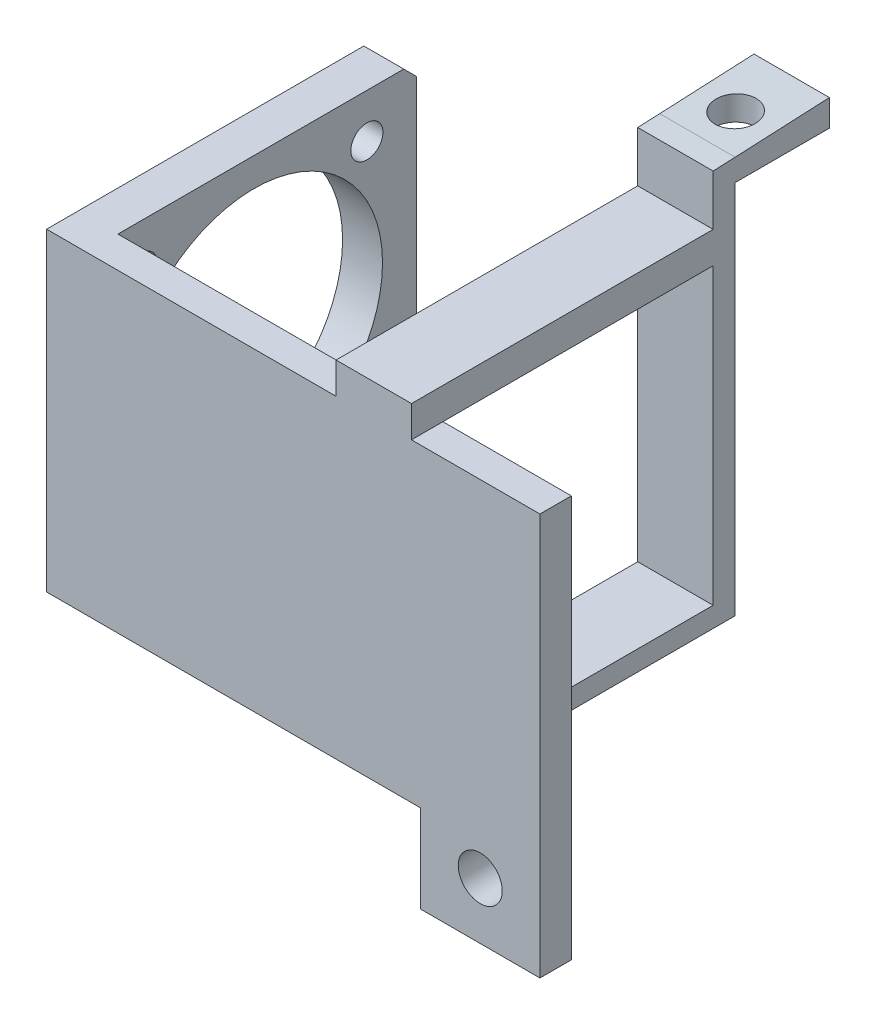
ISO-10303-21;
HEADER;
FILE_DESCRIPTION(('STEP AP214'),'2;1');
FILE_NAME('part.step','',(''),(''),'','','');
FILE_SCHEMA(('AUTOMOTIVE_DESIGN { 1 0 10303 214 1 1 1 1 }'));
ENDSEC;
DATA;
#1=APPLICATION_CONTEXT('core data for automotive mechanical design processes');
#2=APPLICATION_PROTOCOL_DEFINITION('international standard','automotive_design',2000,#1);
#3=PRODUCT_CONTEXT('',#1,'mechanical');
#4=PRODUCT('Part','Part','',(#3));
#5=PRODUCT_RELATED_PRODUCT_CATEGORY('part','',(#4));
#6=PRODUCT_DEFINITION_FORMATION('','',#4);
#7=PRODUCT_DEFINITION_CONTEXT('part definition',#1,'design');
#8=PRODUCT_DEFINITION('design','',#6,#7);
#9=PRODUCT_DEFINITION_SHAPE('','',#8);
#10=(LENGTH_UNIT() NAMED_UNIT(*) SI_UNIT(.MILLI.,.METRE.));
#11=(NAMED_UNIT(*) PLANE_ANGLE_UNIT() SI_UNIT($,.RADIAN.));
#12=(NAMED_UNIT(*) SI_UNIT($,.STERADIAN.) SOLID_ANGLE_UNIT());
#13=UNCERTAINTY_MEASURE_WITH_UNIT(LENGTH_MEASURE(1.E-05),#10,'distance_accuracy_value','');
#14=(GEOMETRIC_REPRESENTATION_CONTEXT(3) GLOBAL_UNCERTAINTY_ASSIGNED_CONTEXT((#13)) GLOBAL_UNIT_ASSIGNED_CONTEXT((#10,
#11,#12)) REPRESENTATION_CONTEXT('',''));
#15=CARTESIAN_POINT('',(0.,0.,0.));
#16=DIRECTION('',(0.,0.,1.));
#17=DIRECTION('',(1.,0.,0.));
#18=AXIS2_PLACEMENT_3D('',#15,#16,#17);
#19=CARTESIAN_POINT('',(0.,0.,0.));
#20=DIRECTION('',(0.,0.,-1.));
#21=DIRECTION('',(-1.,0.,0.));
#22=AXIS2_PLACEMENT_3D('',#19,#20,#21);
#23=PLANE('',#22);
#24=CARTESIAN_POINT('',(69.,-4.93898511090853,0.));
#25=DIRECTION('',(0.,0.,-1.));
#26=DIRECTION('',(-1.,0.,0.));
#27=AXIS2_PLACEMENT_3D('',#24,#25,#26);
#28=CIRCLE('',#27,3.50000000000001);
#29=CARTESIAN_POINT('',(65.5,-4.93898511090853,0.));
#30=VERTEX_POINT('',#29);
#31=EDGE_CURVE('E310',#30,#30,#28,.T.);
#32=ORIENTED_EDGE('',*,*,#31,.F.);
#33=EDGE_LOOP('',(#32));
#34=FACE_BOUND('',#33,.T.);
#35=DIRECTION('',(-1.,0.,0.));
#36=VECTOR('',#35,1.);
#37=CARTESIAN_POINT('',(0.,50.,0.));
#38=LINE('',#37,#36);
#39=CARTESIAN_POINT('',(46.06,50.,0.));
#40=VERTEX_POINT('',#39);
#41=CARTESIAN_POINT('',(6.35,50.,0.));
#42=VERTEX_POINT('',#41);
#43=EDGE_CURVE('E352',#40,#42,#38,.T.);
#44=ORIENTED_EDGE('',*,*,#43,.F.);
#45=DIRECTION('',(-1.,0.,0.));
#46=VECTOR('',#45,1.);
#47=CARTESIAN_POINT('',(58.06,50.,0.));
#48=LINE('',#47,#46);
#49=CARTESIAN_POINT('',(58.06,50.,0.));
#50=VERTEX_POINT('',#49);
#51=EDGE_CURVE('E223',#50,#40,#48,.T.);
#52=ORIENTED_EDGE('',*,*,#51,.F.);
#53=DIRECTION('',(-1.,0.,0.));
#54=VECTOR('',#53,1.);
#55=CARTESIAN_POINT('',(58.06,50.,0.));
#56=LINE('',#55,#54);
#57=CARTESIAN_POINT('',(78.5,50.,0.));
#58=VERTEX_POINT('',#57);
#59=EDGE_CURVE('E382',#58,#50,#56,.T.);
#60=ORIENTED_EDGE('',*,*,#59,.F.);
#61=DIRECTION('',(0.,1.,0.));
#62=VECTOR('',#61,1.);
#63=CARTESIAN_POINT('',(78.5,64.0610148890915,0.));
#64=LINE('',#63,#62);
#65=CARTESIAN_POINT('',(78.5,-13.9389851109085,0.));
#66=VERTEX_POINT('',#65);
#67=EDGE_CURVE('E379',#66,#58,#64,.T.);
#68=ORIENTED_EDGE('',*,*,#67,.F.);
#69=DIRECTION('',(1.,0.,0.));
#70=VECTOR('',#69,1.);
#71=CARTESIAN_POINT('',(78.5,-13.9389851109085,0.));
#72=LINE('',#71,#70);
#73=CARTESIAN_POINT('',(59.5,-13.9389851109085,0.));
#74=VERTEX_POINT('',#73);
#75=EDGE_CURVE('E377',#74,#66,#72,.T.);
#76=ORIENTED_EDGE('',*,*,#75,.F.);
#77=DIRECTION('',(0.,-1.,0.));
#78=VECTOR('',#77,1.);
#79=CARTESIAN_POINT('',(59.5,-13.9389851109085,0.));
#80=LINE('',#79,#78);
#81=CARTESIAN_POINT('',(59.5,0.,0.));
#82=VERTEX_POINT('',#81);
#83=EDGE_CURVE('E375',#82,#74,#80,.T.);
#84=ORIENTED_EDGE('',*,*,#83,.F.);
#85=DIRECTION('',(1.,0.,0.));
#86=VECTOR('',#85,1.);
#87=CARTESIAN_POINT('',(59.5,0.,0.));
#88=LINE('',#87,#86);
#89=CARTESIAN_POINT('',(58.06,0.,0.));
#90=VERTEX_POINT('',#89);
#91=EDGE_CURVE('E347',#90,#82,#88,.T.);
#92=ORIENTED_EDGE('',*,*,#91,.F.);
#93=DIRECTION('',(0.,-1.,0.));
#94=VECTOR('',#93,1.);
#95=CARTESIAN_POINT('',(58.06,0.,0.));
#96=LINE('',#95,#94);
#97=CARTESIAN_POINT('',(58.06,3.2,0.));
#98=VERTEX_POINT('',#97);
#99=EDGE_CURVE('E283',#98,#90,#96,.T.);
#100=ORIENTED_EDGE('',*,*,#99,.F.);
#101=DIRECTION('',(1.,0.,0.));
#102=VECTOR('',#101,1.);
#103=CARTESIAN_POINT('',(58.06,3.2,0.));
#104=LINE('',#103,#102);
#105=CARTESIAN_POINT('',(46.06,3.2,0.));
#106=VERTEX_POINT('',#105);
#107=EDGE_CURVE('E287',#106,#98,#104,.T.);
#108=ORIENTED_EDGE('',*,*,#107,.F.);
#109=DIRECTION('',(0.,1.,0.));
#110=VECTOR('',#109,1.);
#111=CARTESIAN_POINT('',(46.06,0.,0.));
#112=LINE('',#111,#110);
#113=CARTESIAN_POINT('',(46.06,0.,0.));
#114=VERTEX_POINT('',#113);
#115=EDGE_CURVE('E295',#114,#106,#112,.T.);
#116=ORIENTED_EDGE('',*,*,#115,.F.);
#117=CARTESIAN_POINT('',(6.35,0.,0.));
#118=VERTEX_POINT('',#117);
#119=EDGE_CURVE('E372',#118,#114,#88,.T.);
#120=ORIENTED_EDGE('',*,*,#119,.F.);
#121=DIRECTION('',(0.,-1.,0.));
#122=VECTOR('',#121,1.);
#123=CARTESIAN_POINT('',(6.35,0.,0.));
#124=LINE('',#123,#122);
#125=EDGE_CURVE('E340',#42,#118,#124,.T.);
#126=ORIENTED_EDGE('',*,*,#125,.F.);
#127=EDGE_LOOP('',(#44,#52,#60,#68,#76,#84,#92,#100,#108,#116,#120,#126));
#128=FACE_BOUND('',#127,.T.);
#129=ADVANCED_FACE('F38',(#34,#128),#23,.T.);
#130=CARTESIAN_POINT('',(46.06,75.6254310840446,-43.));
#131=DIRECTION('',(0.,0.,-1.));
#132=DIRECTION('',(-1.,0.,0.));
#133=AXIS2_PLACEMENT_3D('',#130,#131,#132);
#134=PLANE('',#133);
#135=DIRECTION('',(1.,0.,0.));
#136=VECTOR('',#135,1.);
#137=CARTESIAN_POINT('',(58.06,55.,-43.));
#138=LINE('',#137,#136);
#139=CARTESIAN_POINT('',(46.06,55.,-43.));
#140=VERTEX_POINT('',#139);
#141=CARTESIAN_POINT('',(58.06,55.,-43.));
#142=VERTEX_POINT('',#141);
#143=EDGE_CURVE('E215',#140,#142,#138,.T.);
#144=ORIENTED_EDGE('',*,*,#143,.T.);
#145=DIRECTION('',(0.,-1.,0.));
#146=VECTOR('',#145,1.);
#147=CARTESIAN_POINT('',(58.06,75.6254310840446,-43.));
#148=LINE('',#147,#146);
#149=CARTESIAN_POINT('',(58.06,63.0420285309648,-43.));
#150=VERTEX_POINT('',#149);
#151=EDGE_CURVE('E206',#150,#142,#148,.T.);
#152=ORIENTED_EDGE('',*,*,#151,.F.);
#153=DIRECTION('',(1.,0.,0.));
#154=VECTOR('',#153,1.);
#155=CARTESIAN_POINT('',(46.06,63.0420285309648,-43.));
#156=LINE('',#155,#154);
#157=CARTESIAN_POINT('',(46.06,63.0420285309648,-43.));
#158=VERTEX_POINT('',#157);
#159=EDGE_CURVE('E270',#158,#150,#156,.T.);
#160=ORIENTED_EDGE('',*,*,#159,.F.);
#161=DIRECTION('',(0.,-1.,0.));
#162=VECTOR('',#161,1.);
#163=CARTESIAN_POINT('',(46.06,75.6254310840446,-43.));
#164=LINE('',#163,#162);
#165=EDGE_CURVE('E271',#158,#140,#164,.T.);
#166=ORIENTED_EDGE('',*,*,#165,.T.);
#167=EDGE_LOOP('',(#144,#152,#160,#166));
#168=FACE_BOUND('',#167,.T.);
#169=ADVANCED_FACE('F497',(#168),#134,.F.);
#170=DIRECTION('',(-1.,0.,0.));
#171=VECTOR('',#170,1.);
#172=CARTESIAN_POINT('',(58.06,50.,-43.));
#173=LINE('',#172,#171);
#174=CARTESIAN_POINT('',(58.06,50.,-43.));
#175=VERTEX_POINT('',#174);
#176=CARTESIAN_POINT('',(46.06,50.,-43.));
#177=VERTEX_POINT('',#176);
#178=EDGE_CURVE('E62',#175,#177,#173,.T.);
#179=ORIENTED_EDGE('',*,*,#178,.T.);
#180=CARTESIAN_POINT('',(46.06,3.2,-43.));
#181=VERTEX_POINT('',#180);
#182=EDGE_CURVE('E278',#177,#181,#164,.T.);
#183=ORIENTED_EDGE('',*,*,#182,.T.);
#184=DIRECTION('',(1.,0.,0.));
#185=VECTOR('',#184,1.);
#186=CARTESIAN_POINT('',(46.06,3.2,-43.));
#187=LINE('',#186,#185);
#188=CARTESIAN_POINT('',(58.06,3.2,-43.));
#189=VERTEX_POINT('',#188);
#190=EDGE_CURVE('E202',#181,#189,#187,.T.);
#191=ORIENTED_EDGE('',*,*,#190,.T.);
#192=EDGE_CURVE('E199',#175,#189,#148,.T.);
#193=ORIENTED_EDGE('',*,*,#192,.F.);
#194=EDGE_LOOP('',(#179,#183,#191,#193));
#195=FACE_BOUND('',#194,.T.);
#196=ADVANCED_FACE('F200',(#195),#134,.F.);
#197=CARTESIAN_POINT('',(0.,0.,-46.5));
#198=DIRECTION('',(0.,0.,1.));
#199=DIRECTION('',(1.,0.,0.));
#200=AXIS2_PLACEMENT_3D('',#197,#198,#199);
#201=PLANE('',#200);
#202=DIRECTION('',(-1.,0.,0.));
#203=VECTOR('',#202,1.);
#204=CARTESIAN_POINT('',(58.06,59.6966428528848,-46.5));
#205=LINE('',#204,#203);
#206=CARTESIAN_POINT('',(58.06,59.6966428528848,-46.5));
#207=VERTEX_POINT('',#206);
#208=CARTESIAN_POINT('',(46.06,59.6966428528848,-46.5));
#209=VERTEX_POINT('',#208);
#210=EDGE_CURVE('E252',#207,#209,#205,.T.);
#211=ORIENTED_EDGE('',*,*,#210,.F.);
#212=DIRECTION('',(0.,-1.,0.));
#213=VECTOR('',#212,1.);
#214=CARTESIAN_POINT('',(58.06,0.,-46.5));
#215=LINE('',#214,#213);
#216=CARTESIAN_POINT('',(58.06,0.,-46.5));
#217=VERTEX_POINT('',#216);
#218=EDGE_CURVE('E284',#207,#217,#215,.T.);
#219=ORIENTED_EDGE('',*,*,#218,.T.);
#220=DIRECTION('',(-1.,0.,0.));
#221=VECTOR('',#220,1.);
#222=CARTESIAN_POINT('',(58.06,0.,-46.5));
#223=LINE('',#222,#221);
#224=CARTESIAN_POINT('',(46.06,0.,-46.5));
#225=VERTEX_POINT('',#224);
#226=EDGE_CURVE('E286',#217,#225,#223,.T.);
#227=ORIENTED_EDGE('',*,*,#226,.T.);
#228=DIRECTION('',(0.,1.,0.));
#229=VECTOR('',#228,1.);
#230=CARTESIAN_POINT('',(46.06,0.,-46.5));
#231=LINE('',#230,#229);
#232=EDGE_CURVE('E289',#225,#209,#231,.T.);
#233=ORIENTED_EDGE('',*,*,#232,.T.);
#234=EDGE_LOOP('',(#211,#219,#227,#233));
#235=FACE_BOUND('',#234,.T.);
#236=ADVANCED_FACE('F467',(#235),#201,.F.);
#237=CARTESIAN_POINT('',(58.06,3.2,-46.5));
#238=DIRECTION('',(0.,-1.,0.));
#239=DIRECTION('',(0.,0.,-1.));
#240=AXIS2_PLACEMENT_3D('',#237,#238,#239);
#241=PLANE('',#240);
#242=ORIENTED_EDGE('',*,*,#190,.F.);
#243=DIRECTION('',(0.,0.,1.));
#244=VECTOR('',#243,1.);
#245=CARTESIAN_POINT('',(46.06,3.2,-46.5));
#246=LINE('',#245,#244);
#247=EDGE_CURVE('E301',#181,#106,#246,.T.);
#248=ORIENTED_EDGE('',*,*,#247,.T.);
#249=ORIENTED_EDGE('',*,*,#107,.T.);
#250=DIRECTION('',(0.,0.,1.));
#251=VECTOR('',#250,1.);
#252=CARTESIAN_POINT('',(58.06,3.2,-46.5));
#253=LINE('',#252,#251);
#254=EDGE_CURVE('E292',#189,#98,#253,.T.);
#255=ORIENTED_EDGE('',*,*,#254,.F.);
#256=EDGE_LOOP('',(#242,#248,#249,#255));
#257=FACE_BOUND('',#256,.T.);
#258=ADVANCED_FACE('F486',(#257),#241,.F.);
#259=CARTESIAN_POINT('',(59.5,0.,5.));
#260=DIRECTION('',(0.,1.,0.));
#261=DIRECTION('',(-1.,0.,0.));
#262=AXIS2_PLACEMENT_3D('',#259,#260,#261);
#263=PLANE('',#262);
#264=DIRECTION('',(0.,0.,-1.));
#265=VECTOR('',#264,1.);
#266=CARTESIAN_POINT('',(0.,0.,5.));
#267=LINE('',#266,#265);
#268=CARTESIAN_POINT('',(0.,0.,5.));
#269=VERTEX_POINT('',#268);
#270=CARTESIAN_POINT('',(0.,0.,-45.48));
#271=VERTEX_POINT('',#270);
#272=EDGE_CURVE('E371',#269,#271,#267,.T.);
#273=ORIENTED_EDGE('',*,*,#272,.T.);
#274=DIRECTION('',(1.,0.,0.));
#275=VECTOR('',#274,1.);
#276=CARTESIAN_POINT('',(59.5,0.,-45.48));
#277=LINE('',#276,#275);
#278=CARTESIAN_POINT('',(6.35,0.,-45.48));
#279=VERTEX_POINT('',#278);
#280=EDGE_CURVE('E408',#271,#279,#277,.T.);
#281=ORIENTED_EDGE('',*,*,#280,.T.);
#282=DIRECTION('',(0.,0.,1.));
#283=VECTOR('',#282,1.);
#284=CARTESIAN_POINT('',(6.35,0.,-52.48));
#285=LINE('',#284,#283);
#286=EDGE_CURVE('E343',#279,#118,#285,.T.);
#287=ORIENTED_EDGE('',*,*,#286,.T.);
#288=ORIENTED_EDGE('',*,*,#119,.T.);
#289=DIRECTION('',(0.,0.,1.));
#290=VECTOR('',#289,1.);
#291=CARTESIAN_POINT('',(46.06,0.,-46.5));
#292=LINE('',#291,#290);
#293=EDGE_CURVE('E303',#225,#114,#292,.T.);
#294=ORIENTED_EDGE('',*,*,#293,.F.);
#295=ORIENTED_EDGE('',*,*,#226,.F.);
#296=DIRECTION('',(0.,0.,1.));
#297=VECTOR('',#296,1.);
#298=CARTESIAN_POINT('',(58.06,0.,-46.5));
#299=LINE('',#298,#297);
#300=EDGE_CURVE('E305',#217,#90,#299,.T.);
#301=ORIENTED_EDGE('',*,*,#300,.T.);
#302=ORIENTED_EDGE('',*,*,#91,.T.);
#303=DIRECTION('',(0.,0.,-1.));
#304=VECTOR('',#303,1.);
#305=CARTESIAN_POINT('',(59.5,0.,5.));
#306=LINE('',#305,#304);
#307=CARTESIAN_POINT('',(59.5,0.,5.));
#308=VERTEX_POINT('',#307);
#309=EDGE_CURVE('E405',#308,#82,#306,.T.);
#310=ORIENTED_EDGE('',*,*,#309,.F.);
#311=DIRECTION('',(1.,0.,0.));
#312=VECTOR('',#311,1.);
#313=CARTESIAN_POINT('',(59.5,0.,5.));
#314=LINE('',#313,#312);
#315=EDGE_CURVE('E348',#269,#308,#314,.T.);
#316=ORIENTED_EDGE('',*,*,#315,.F.);
#317=EDGE_LOOP('',(#273,#281,#287,#288,#294,#295,#301,#302,#310,#316));
#318=FACE_BOUND('',#317,.T.);
#319=ADVANCED_FACE('F432',(#318),#263,.F.);
#320=CARTESIAN_POINT('',(59.5,-13.9389851109085,5.));
#321=DIRECTION('',(1.,0.,0.));
#322=DIRECTION('',(0.,0.,-1.));
#323=AXIS2_PLACEMENT_3D('',#320,#321,#322);
#324=PLANE('',#323);
#325=ORIENTED_EDGE('',*,*,#83,.T.);
#326=DIRECTION('',(0.,0.,-1.));
#327=VECTOR('',#326,1.);
#328=CARTESIAN_POINT('',(59.5,-13.9389851109085,5.));
#329=LINE('',#328,#327);
#330=CARTESIAN_POINT('',(59.5,-13.9389851109085,5.));
#331=VERTEX_POINT('',#330);
#332=EDGE_CURVE('E402',#331,#74,#329,.T.);
#333=ORIENTED_EDGE('',*,*,#332,.F.);
#334=DIRECTION('',(0.,-1.,0.));
#335=VECTOR('',#334,1.);
#336=CARTESIAN_POINT('',(59.5,-13.9389851109085,5.));
#337=LINE('',#336,#335);
#338=EDGE_CURVE('E351',#308,#331,#337,.T.);
#339=ORIENTED_EDGE('',*,*,#338,.F.);
#340=ORIENTED_EDGE('',*,*,#309,.T.);
#341=EDGE_LOOP('',(#325,#333,#339,#340));
#342=FACE_BOUND('',#341,.T.);
#343=ADVANCED_FACE('F478',(#342),#324,.F.);
#344=CARTESIAN_POINT('',(78.5,-13.9389851109085,5.));
#345=DIRECTION('',(0.,1.,0.));
#346=DIRECTION('',(-1.,0.,0.));
#347=AXIS2_PLACEMENT_3D('',#344,#345,#346);
#348=PLANE('',#347);
#349=ORIENTED_EDGE('',*,*,#75,.T.);
#350=DIRECTION('',(0.,0.,-1.));
#351=VECTOR('',#350,1.);
#352=CARTESIAN_POINT('',(78.5,-13.9389851109085,5.));
#353=LINE('',#352,#351);
#354=CARTESIAN_POINT('',(78.5,-13.9389851109085,5.));
#355=VERTEX_POINT('',#354);
#356=EDGE_CURVE('E399',#355,#66,#353,.T.);
#357=ORIENTED_EDGE('',*,*,#356,.F.);
#358=DIRECTION('',(1.,0.,0.));
#359=VECTOR('',#358,1.);
#360=CARTESIAN_POINT('',(78.5,-13.9389851109085,5.));
#361=LINE('',#360,#359);
#362=EDGE_CURVE('E354',#331,#355,#361,.T.);
#363=ORIENTED_EDGE('',*,*,#362,.F.);
#364=ORIENTED_EDGE('',*,*,#332,.T.);
#365=EDGE_LOOP('',(#349,#357,#363,#364));
#366=FACE_BOUND('',#365,.T.);
#367=ADVANCED_FACE('F528',(#366),#348,.F.);
#368=CARTESIAN_POINT('',(78.5,64.0610148890915,5.));
#369=DIRECTION('',(-1.,0.,0.));
#370=DIRECTION('',(0.,-1.,0.));
#371=AXIS2_PLACEMENT_3D('',#368,#369,#370);
#372=PLANE('',#371);
#373=ORIENTED_EDGE('',*,*,#67,.T.);
#374=DIRECTION('',(0.,0.,-1.));
#375=VECTOR('',#374,1.);
#376=CARTESIAN_POINT('',(78.5,50.,5.001));
#377=LINE('',#376,#375);
#378=CARTESIAN_POINT('',(78.5,50.,5.));
#379=VERTEX_POINT('',#378);
#380=EDGE_CURVE('E307',#379,#58,#377,.T.);
#381=ORIENTED_EDGE('',*,*,#380,.F.);
#382=DIRECTION('',(0.,1.,0.));
#383=VECTOR('',#382,1.);
#384=CARTESIAN_POINT('',(78.5,64.0610148890915,5.));
#385=LINE('',#384,#383);
#386=EDGE_CURVE('E356',#355,#379,#385,.T.);
#387=ORIENTED_EDGE('',*,*,#386,.F.);
#388=ORIENTED_EDGE('',*,*,#356,.T.);
#389=EDGE_LOOP('',(#373,#381,#387,#388));
#390=FACE_BOUND('',#389,.T.);
#391=ADVANCED_FACE('F524',(#390),#372,.F.);
#392=CARTESIAN_POINT('',(58.06,50.,5.));
#393=DIRECTION('',(0.,-1.,0.));
#394=DIRECTION('',(1.,0.,0.));
#395=AXIS2_PLACEMENT_3D('',#392,#393,#394);
#396=PLANE('',#395);
#397=ORIENTED_EDGE('',*,*,#59,.T.);
#398=DIRECTION('',(0.,0.,-1.));
#399=VECTOR('',#398,1.);
#400=CARTESIAN_POINT('',(58.06,50.,5.));
#401=LINE('',#400,#399);
#402=CARTESIAN_POINT('',(58.06,50.,5.));
#403=VERTEX_POINT('',#402);
#404=EDGE_CURVE('E221',#403,#50,#401,.T.);
#405=ORIENTED_EDGE('',*,*,#404,.F.);
#406=DIRECTION('',(-1.,0.,0.));
#407=VECTOR('',#406,1.);
#408=CARTESIAN_POINT('',(58.06,50.,5.));
#409=LINE('',#408,#407);
#410=EDGE_CURVE('E359',#379,#403,#409,.T.);
#411=ORIENTED_EDGE('',*,*,#410,.F.);
#412=ORIENTED_EDGE('',*,*,#380,.T.);
#413=EDGE_LOOP('',(#397,#405,#411,#412));
#414=FACE_BOUND('',#413,.T.);
#415=ADVANCED_FACE('F521',(#414),#396,.F.);
#416=CARTESIAN_POINT('',(58.06,50.,5.));
#417=DIRECTION('',(-1.,0.,0.));
#418=DIRECTION('',(0.,0.,1.));
#419=AXIS2_PLACEMENT_3D('',#416,#417,#418);
#420=PLANE('',#419);
#421=ORIENTED_EDGE('',*,*,#404,.T.);
#422=DIRECTION('',(0.,0.,1.));
#423=VECTOR('',#422,1.);
#424=CARTESIAN_POINT('',(58.06,50.,-61.502));
#425=LINE('',#424,#423);
#426=EDGE_CURVE('E211',#175,#50,#425,.T.);
#427=ORIENTED_EDGE('',*,*,#426,.F.);
#428=ORIENTED_EDGE('',*,*,#192,.T.);
#429=ORIENTED_EDGE('',*,*,#254,.T.);
#430=ORIENTED_EDGE('',*,*,#99,.T.);
#431=ORIENTED_EDGE('',*,*,#300,.F.);
#432=ORIENTED_EDGE('',*,*,#218,.F.);
#433=DIRECTION('',(0.,0.,1.));
#434=VECTOR('',#433,1.);
#435=CARTESIAN_POINT('',(58.06,59.6966428528848,-61.5));
#436=LINE('',#435,#434);
#437=CARTESIAN_POINT('',(58.06,59.6966428528848,-61.5));
#438=VERTEX_POINT('',#437);
#439=EDGE_CURVE('E265',#438,#207,#436,.T.);
#440=ORIENTED_EDGE('',*,*,#439,.F.);
#441=DIRECTION('',(0.,-1.,0.));
#442=VECTOR('',#441,1.);
#443=CARTESIAN_POINT('',(58.06,63.1966428528848,-61.5));
#444=LINE('',#443,#442);
#445=CARTESIAN_POINT('',(58.06,63.9166428528848,-61.5));
#446=VERTEX_POINT('',#445);
#447=EDGE_CURVE('E253',#446,#438,#444,.T.);
#448=ORIENTED_EDGE('',*,*,#447,.F.);
#449=DIRECTION('',(0.,0.0479447993683981,-0.99884998684163));
#450=VECTOR('',#449,1.);
#451=CARTESIAN_POINT('',(58.0600000000001,63.196642852885,-46.5));
#452=LINE('',#451,#450);
#453=CARTESIAN_POINT('',(58.0600000000001,63.196642852885,-46.5));
#454=VERTEX_POINT('',#453);
#455=EDGE_CURVE('E248',#454,#446,#452,.T.);
#456=ORIENTED_EDGE('',*,*,#455,.F.);
#457=DIRECTION('',(0.,0.044132479785462,-0.999025687471541));
#458=VECTOR('',#457,1.);
#459=CARTESIAN_POINT('',(58.06,63.2208501025982,-47.0479788220425));
#460=LINE('',#459,#458);
#461=EDGE_CURVE('E267',#150,#454,#460,.T.);
#462=ORIENTED_EDGE('',*,*,#461,.F.);
#463=ORIENTED_EDGE('',*,*,#151,.T.);
#464=DIRECTION('',(0.,0.,-1.));
#465=VECTOR('',#464,1.);
#466=CARTESIAN_POINT('',(58.06,55.,5.));
#467=LINE('',#466,#465);
#468=CARTESIAN_POINT('',(58.06,55.,5.));
#469=VERTEX_POINT('',#468);
#470=EDGE_CURVE('E54',#469,#142,#467,.T.);
#471=ORIENTED_EDGE('',*,*,#470,.F.);
#472=DIRECTION('',(0.,1.,0.));
#473=VECTOR('',#472,1.);
#474=CARTESIAN_POINT('',(58.06,50.,5.));
#475=LINE('',#474,#473);
#476=EDGE_CURVE('E361',#403,#469,#475,.T.);
#477=ORIENTED_EDGE('',*,*,#476,.F.);
#478=EDGE_LOOP('',(#421,#427,#428,#429,#430,#431,#432,#440,#448,#456,#462,#463,#471,#477));
#479=FACE_BOUND('',#478,.T.);
#480=ADVANCED_FACE('F218',(#479),#420,.F.);
#481=CARTESIAN_POINT('',(58.06,55.,5.));
#482=DIRECTION('',(0.,-1.,0.));
#483=DIRECTION('',(1.,0.,0.));
#484=AXIS2_PLACEMENT_3D('',#481,#482,#483);
#485=PLANE('',#484);
#486=ORIENTED_EDGE('',*,*,#470,.T.);
#487=ORIENTED_EDGE('',*,*,#143,.F.);
#488=DIRECTION('',(0.,0.,-1.));
#489=VECTOR('',#488,1.);
#490=CARTESIAN_POINT('',(46.06,55.,5.));
#491=LINE('',#490,#489);
#492=CARTESIAN_POINT('',(46.06,55.,5.));
#493=VERTEX_POINT('',#492);
#494=EDGE_CURVE('E395',#493,#140,#491,.T.);
#495=ORIENTED_EDGE('',*,*,#494,.F.);
#496=DIRECTION('',(-1.,0.,0.));
#497=VECTOR('',#496,1.);
#498=CARTESIAN_POINT('',(58.06,55.,5.));
#499=LINE('',#498,#497);
#500=EDGE_CURVE('E363',#469,#493,#499,.T.);
#501=ORIENTED_EDGE('',*,*,#500,.F.);
#502=EDGE_LOOP('',(#486,#487,#495,#501));
#503=FACE_BOUND('',#502,.T.);
#504=ADVANCED_FACE('F516',(#503),#485,.F.);
#505=CARTESIAN_POINT('',(46.06,55.,5.));
#506=DIRECTION('',(1.,0.,0.));
#507=DIRECTION('',(0.,1.,0.));
#508=AXIS2_PLACEMENT_3D('',#505,#506,#507);
#509=PLANE('',#508);
#510=ORIENTED_EDGE('',*,*,#494,.T.);
#511=ORIENTED_EDGE('',*,*,#165,.F.);
#512=DIRECTION('',(0.,-0.044132479785462,0.999025687471541));
#513=VECTOR('',#512,1.);
#514=CARTESIAN_POINT('',(46.06,63.2208501025982,-47.0479788220425));
#515=LINE('',#514,#513);
#516=CARTESIAN_POINT('',(46.06,63.196642852885,-46.5));
#517=VERTEX_POINT('',#516);
#518=EDGE_CURVE('E273',#517,#158,#515,.T.);
#519=ORIENTED_EDGE('',*,*,#518,.F.);
#520=DIRECTION('',(0.,-0.0479447993683981,0.99884998684163));
#521=VECTOR('',#520,1.);
#522=CARTESIAN_POINT('',(46.06,63.196642852885,-46.5));
#523=LINE('',#522,#521);
#524=CARTESIAN_POINT('',(46.06,63.916642852885,-61.5));
#525=VERTEX_POINT('',#524);
#526=EDGE_CURVE('E246',#525,#517,#523,.T.);
#527=ORIENTED_EDGE('',*,*,#526,.F.);
#528=DIRECTION('',(0.,1.,0.));
#529=VECTOR('',#528,1.);
#530=CARTESIAN_POINT('',(46.06,63.1966428528848,-61.5));
#531=LINE('',#530,#529);
#532=CARTESIAN_POINT('',(46.06,59.6966428528848,-61.5));
#533=VERTEX_POINT('',#532);
#534=EDGE_CURVE('E258',#533,#525,#531,.T.);
#535=ORIENTED_EDGE('',*,*,#534,.F.);
#536=DIRECTION('',(0.,0.,1.));
#537=VECTOR('',#536,1.);
#538=CARTESIAN_POINT('',(46.06,59.6966428528848,-61.5));
#539=LINE('',#538,#537);
#540=EDGE_CURVE('E261',#533,#209,#539,.T.);
#541=ORIENTED_EDGE('',*,*,#540,.T.);
#542=ORIENTED_EDGE('',*,*,#232,.F.);
#543=ORIENTED_EDGE('',*,*,#293,.T.);
#544=ORIENTED_EDGE('',*,*,#115,.T.);
#545=ORIENTED_EDGE('',*,*,#247,.F.);
#546=ORIENTED_EDGE('',*,*,#182,.F.);
#547=DIRECTION('',(0.,0.,1.));
#548=VECTOR('',#547,1.);
#549=CARTESIAN_POINT('',(46.06,50.,-61.502));
#550=LINE('',#549,#548);
#551=EDGE_CURVE('E214',#177,#40,#550,.T.);
#552=ORIENTED_EDGE('',*,*,#551,.T.);
#553=DIRECTION('',(0.,0.,-1.));
#554=VECTOR('',#553,1.);
#555=CARTESIAN_POINT('',(46.06,50.,5.));
#556=LINE('',#555,#554);
#557=CARTESIAN_POINT('',(46.06,50.,5.));
#558=VERTEX_POINT('',#557);
#559=EDGE_CURVE('E392',#558,#40,#556,.T.);
#560=ORIENTED_EDGE('',*,*,#559,.F.);
#561=DIRECTION('',(0.,-1.,0.));
#562=VECTOR('',#561,1.);
#563=CARTESIAN_POINT('',(46.06,55.,5.));
#564=LINE('',#563,#562);
#565=EDGE_CURVE('E365',#493,#558,#564,.T.);
#566=ORIENTED_EDGE('',*,*,#565,.F.);
#567=EDGE_LOOP('',(#510,#511,#519,#527,#535,#541,#542,#543,#544,#545,#546,#552,#560,#566));
#568=FACE_BOUND('',#567,.T.);
#569=ADVANCED_FACE('F462',(#568),#509,.F.);
#570=CARTESIAN_POINT('',(0.,50.,5.));
#571=DIRECTION('',(0.,-1.,0.));
#572=DIRECTION('',(1.,0.,0.));
#573=AXIS2_PLACEMENT_3D('',#570,#571,#572);
#574=PLANE('',#573);
#575=DIRECTION('',(0.,0.,1.));
#576=VECTOR('',#575,1.);
#577=CARTESIAN_POINT('',(6.35,50.,-52.48));
#578=LINE('',#577,#576);
#579=CARTESIAN_POINT('',(6.35,50.,-45.48));
#580=VERTEX_POINT('',#579);
#581=EDGE_CURVE('E345',#580,#42,#578,.T.);
#582=ORIENTED_EDGE('',*,*,#581,.F.);
#583=DIRECTION('',(-1.,0.,0.));
#584=VECTOR('',#583,1.);
#585=CARTESIAN_POINT('',(0.,50.,-45.48));
#586=LINE('',#585,#584);
#587=CARTESIAN_POINT('',(0.,50.,-45.48));
#588=VERTEX_POINT('',#587);
#589=EDGE_CURVE('E11',#580,#588,#586,.T.);
#590=ORIENTED_EDGE('',*,*,#589,.T.);
#591=DIRECTION('',(0.,0.,-1.));
#592=VECTOR('',#591,1.);
#593=CARTESIAN_POINT('',(0.,50.,5.));
#594=LINE('',#593,#592);
#595=CARTESIAN_POINT('',(0.,50.,5.));
#596=VERTEX_POINT('',#595);
#597=EDGE_CURVE('E389',#596,#588,#594,.T.);
#598=ORIENTED_EDGE('',*,*,#597,.F.);
#599=DIRECTION('',(-1.,0.,0.));
#600=VECTOR('',#599,1.);
#601=CARTESIAN_POINT('',(0.,50.,5.));
#602=LINE('',#601,#600);
#603=EDGE_CURVE('E367',#558,#596,#602,.T.);
#604=ORIENTED_EDGE('',*,*,#603,.F.);
#605=ORIENTED_EDGE('',*,*,#559,.T.);
#606=ORIENTED_EDGE('',*,*,#43,.T.);
#607=EDGE_LOOP('',(#582,#590,#598,#604,#605,#606));
#608=FACE_BOUND('',#607,.T.);
#609=ADVANCED_FACE('F448',(#608),#574,.F.);
#610=CARTESIAN_POINT('',(0.,0.,5.));
#611=DIRECTION('',(1.,0.,0.));
#612=DIRECTION('',(0.,0.,-1.));
#613=AXIS2_PLACEMENT_3D('',#610,#611,#612);
#614=PLANE('',#613);
#615=CARTESIAN_POINT('',(0.,7.04500000000006,-3.70499999999993));
#616=DIRECTION('',(1.,0.,0.));
#617=DIRECTION('',(0.,-1.,0.));
#618=AXIS2_PLACEMENT_3D('',#615,#616,#617);
#619=CIRCLE('',#618,2.555);
#620=CARTESIAN_POINT('',(0.,4.49000000000006,-3.70499999999992));
#621=VERTEX_POINT('',#620);
#622=EDGE_CURVE('E231',#621,#621,#619,.F.);
#623=ORIENTED_EDGE('',*,*,#622,.F.);
#624=EDGE_LOOP('',(#623));
#625=FACE_BOUND('',#624,.T.);
#626=CARTESIAN_POINT('',(0.,42.9649999999999,-39.6150000000001));
#627=DIRECTION('',(1.,0.,0.));
#628=DIRECTION('',(0.,-1.,0.));
#629=AXIS2_PLACEMENT_3D('',#626,#627,#628);
#630=CIRCLE('',#629,2.555);
#631=CARTESIAN_POINT('',(0.,40.4099999999999,-39.6150000000001));
#632=VERTEX_POINT('',#631);
#633=EDGE_CURVE('E237',#632,#632,#630,.F.);
#634=ORIENTED_EDGE('',*,*,#633,.F.);
#635=EDGE_LOOP('',(#634));
#636=FACE_BOUND('',#635,.T.);
#637=CARTESIAN_POINT('',(0.,7.045,-39.615));
#638=DIRECTION('',(1.,0.,0.));
#639=DIRECTION('',(0.,0.,-1.));
#640=AXIS2_PLACEMENT_3D('',#637,#638,#639);
#641=CIRCLE('',#640,2.555);
#642=CARTESIAN_POINT('',(0.,7.045,-42.17));
#643=VERTEX_POINT('',#642);
#644=EDGE_CURVE('E321',#643,#643,#641,.F.);
#645=ORIENTED_EDGE('',*,*,#644,.F.);
#646=EDGE_LOOP('',(#645));
#647=FACE_BOUND('',#646,.T.);
#648=CARTESIAN_POINT('',(0.,42.955,-3.695));
#649=DIRECTION('',(1.,0.,0.));
#650=DIRECTION('',(0.,0.,-1.));
#651=AXIS2_PLACEMENT_3D('',#648,#649,#650);
#652=CIRCLE('',#651,2.555);
#653=CARTESIAN_POINT('',(0.,42.955,-6.24999999999999));
#654=VERTEX_POINT('',#653);
#655=EDGE_CURVE('E320',#654,#654,#652,.F.);
#656=ORIENTED_EDGE('',*,*,#655,.F.);
#657=EDGE_LOOP('',(#656));
#658=FACE_BOUND('',#657,.T.);
#659=CARTESIAN_POINT('',(0.,25.,-21.66));
#660=DIRECTION('',(1.,0.,0.));
#661=DIRECTION('',(0.,0.,-1.));
#662=AXIS2_PLACEMENT_3D('',#659,#660,#661);
#663=CIRCLE('',#662,20.44);
#664=CARTESIAN_POINT('',(0.,25.,-42.1));
#665=VERTEX_POINT('',#664);
#666=EDGE_CURVE('E337',#665,#665,#663,.F.);
#667=ORIENTED_EDGE('',*,*,#666,.F.);
#668=EDGE_LOOP('',(#667));
#669=FACE_BOUND('',#668,.T.);
#670=DIRECTION('',(0.,1.,0.));
#671=VECTOR('',#670,1.);
#672=CARTESIAN_POINT('',(0.,50.,-47.48));
#673=LINE('',#672,#671);
#674=CARTESIAN_POINT('',(0.,2.00000000000003,-47.48));
#675=VERTEX_POINT('',#674);
#676=CARTESIAN_POINT('',(0.,48.,-47.48));
#677=VERTEX_POINT('',#676);
#678=EDGE_CURVE('E316',#675,#677,#673,.T.);
#679=ORIENTED_EDGE('',*,*,#678,.F.);
#680=DIRECTION('',(0.,0.707106781186552,-0.707106781186543));
#681=VECTOR('',#680,1.);
#682=CARTESIAN_POINT('',(0.,0.,-45.48));
#683=LINE('',#682,#681);
#684=EDGE_CURVE('E47',#675,#271,#683,.F.);
#685=ORIENTED_EDGE('',*,*,#684,.T.);
#686=ORIENTED_EDGE('',*,*,#272,.F.);
#687=DIRECTION('',(0.,-1.,0.));
#688=VECTOR('',#687,1.);
#689=CARTESIAN_POINT('',(0.,0.,5.));
#690=LINE('',#689,#688);
#691=EDGE_CURVE('E369',#596,#269,#690,.T.);
#692=ORIENTED_EDGE('',*,*,#691,.F.);
#693=ORIENTED_EDGE('',*,*,#597,.T.);
#694=DIRECTION('',(0.,0.707106781186543,0.707106781186552));
#695=VECTOR('',#694,1.);
#696=CARTESIAN_POINT('',(0.,48.,-47.48));
#697=LINE('',#696,#695);
#698=EDGE_CURVE('E420',#588,#677,#697,.F.);
#699=ORIENTED_EDGE('',*,*,#698,.T.);
#700=EDGE_LOOP('',(#679,#685,#686,#692,#693,#699));
#701=FACE_BOUND('',#700,.T.);
#702=ADVANCED_FACE('F425',(#625,#636,#647,#658,#669,#701),#614,.F.);
#703=CARTESIAN_POINT('',(0.,0.,5.));
#704=DIRECTION('',(0.,0.,-1.));
#705=DIRECTION('',(-1.,0.,0.));
#706=AXIS2_PLACEMENT_3D('',#703,#704,#705);
#707=PLANE('',#706);
#708=CARTESIAN_POINT('',(69.,-4.93898511090853,5.));
#709=DIRECTION('',(0.,0.,-1.));
#710=DIRECTION('',(-1.,0.,0.));
#711=AXIS2_PLACEMENT_3D('',#708,#709,#710);
#712=CIRCLE('',#711,3.50000000000001);
#713=CARTESIAN_POINT('',(65.5,-4.93898511090853,5.));
#714=VERTEX_POINT('',#713);
#715=EDGE_CURVE('E313',#714,#714,#712,.F.);
#716=ORIENTED_EDGE('',*,*,#715,.F.);
#717=EDGE_LOOP('',(#716));
#718=FACE_BOUND('',#717,.T.);
#719=ORIENTED_EDGE('',*,*,#386,.T.);
#720=ORIENTED_EDGE('',*,*,#410,.T.);
#721=ORIENTED_EDGE('',*,*,#476,.T.);
#722=ORIENTED_EDGE('',*,*,#500,.T.);
#723=ORIENTED_EDGE('',*,*,#565,.T.);
#724=ORIENTED_EDGE('',*,*,#603,.T.);
#725=ORIENTED_EDGE('',*,*,#691,.T.);
#726=ORIENTED_EDGE('',*,*,#315,.T.);
#727=ORIENTED_EDGE('',*,*,#338,.T.);
#728=ORIENTED_EDGE('',*,*,#362,.T.);
#729=EDGE_LOOP('',(#719,#720,#721,#722,#723,#724,#725,#726,#727,#728));
#730=FACE_BOUND('',#729,.T.);
#731=ADVANCED_FACE('F481',(#718,#730),#707,.F.);
#732=CARTESIAN_POINT('',(6.35,0.,-52.48));
#733=DIRECTION('',(-1.,0.,0.));
#734=DIRECTION('',(0.,0.,1.));
#735=AXIS2_PLACEMENT_3D('',#732,#733,#734);
#736=PLANE('',#735);
#737=CARTESIAN_POINT('',(6.35,7.04500000000006,-3.70499999999993));
#738=DIRECTION('',(1.,0.,0.));
#739=DIRECTION('',(0.,-1.,0.));
#740=AXIS2_PLACEMENT_3D('',#737,#738,#739);
#741=CIRCLE('',#740,2.555);
#742=CARTESIAN_POINT('',(6.35,4.49000000000006,-3.70499999999992));
#743=VERTEX_POINT('',#742);
#744=EDGE_CURVE('E228',#743,#743,#741,.T.);
#745=ORIENTED_EDGE('',*,*,#744,.F.);
#746=EDGE_LOOP('',(#745));
#747=FACE_BOUND('',#746,.T.);
#748=CARTESIAN_POINT('',(6.35,42.9649999999999,-39.6150000000001));
#749=DIRECTION('',(1.,0.,0.));
#750=DIRECTION('',(0.,-1.,0.));
#751=AXIS2_PLACEMENT_3D('',#748,#749,#750);
#752=CIRCLE('',#751,2.555);
#753=CARTESIAN_POINT('',(6.35,40.4099999999999,-39.6150000000001));
#754=VERTEX_POINT('',#753);
#755=EDGE_CURVE('E234',#754,#754,#752,.T.);
#756=ORIENTED_EDGE('',*,*,#755,.F.);
#757=EDGE_LOOP('',(#756));
#758=FACE_BOUND('',#757,.T.);
#759=CARTESIAN_POINT('',(6.35,7.045,-39.615));
#760=DIRECTION('',(1.,0.,0.));
#761=DIRECTION('',(0.,0.,-1.));
#762=AXIS2_PLACEMENT_3D('',#759,#760,#761);
#763=CIRCLE('',#762,2.555);
#764=CARTESIAN_POINT('',(6.35,7.045,-42.17));
#765=VERTEX_POINT('',#764);
#766=EDGE_CURVE('E325',#765,#765,#763,.T.);
#767=ORIENTED_EDGE('',*,*,#766,.F.);
#768=EDGE_LOOP('',(#767));
#769=FACE_BOUND('',#768,.T.);
#770=CARTESIAN_POINT('',(6.35,42.955,-3.695));
#771=DIRECTION('',(1.,0.,0.));
#772=DIRECTION('',(0.,0.,-1.));
#773=AXIS2_PLACEMENT_3D('',#770,#771,#772);
#774=CIRCLE('',#773,2.555);
#775=CARTESIAN_POINT('',(6.35,42.955,-6.24999999999999));
#776=VERTEX_POINT('',#775);
#777=EDGE_CURVE('E317',#776,#776,#774,.T.);
#778=ORIENTED_EDGE('',*,*,#777,.F.);
#779=EDGE_LOOP('',(#778));
#780=FACE_BOUND('',#779,.T.);
#781=CARTESIAN_POINT('',(6.35,25.,-21.66));
#782=DIRECTION('',(1.,0.,0.));
#783=DIRECTION('',(0.,0.,-1.));
#784=AXIS2_PLACEMENT_3D('',#781,#782,#783);
#785=CIRCLE('',#784,20.44);
#786=CARTESIAN_POINT('',(6.35,25.,-42.1));
#787=VERTEX_POINT('',#786);
#788=EDGE_CURVE('E324',#787,#787,#785,.T.);
#789=ORIENTED_EDGE('',*,*,#788,.F.);
#790=EDGE_LOOP('',(#789));
#791=FACE_BOUND('',#790,.T.);
#792=ORIENTED_EDGE('',*,*,#286,.F.);
#793=DIRECTION('',(0.,-0.707106781186552,0.707106781186543));
#794=VECTOR('',#793,1.);
#795=CARTESIAN_POINT('',(6.35,0.,-45.48));
#796=LINE('',#795,#794);
#797=CARTESIAN_POINT('',(6.35,2.00000000000003,-47.48));
#798=VERTEX_POINT('',#797);
#799=EDGE_CURVE('E413',#279,#798,#796,.F.);
#800=ORIENTED_EDGE('',*,*,#799,.T.);
#801=DIRECTION('',(0.,-1.,0.));
#802=VECTOR('',#801,1.);
#803=CARTESIAN_POINT('',(6.35,50.,-47.48));
#804=LINE('',#803,#802);
#805=CARTESIAN_POINT('',(6.35,48.,-47.48));
#806=VERTEX_POINT('',#805);
#807=EDGE_CURVE('E328',#806,#798,#804,.T.);
#808=ORIENTED_EDGE('',*,*,#807,.F.);
#809=DIRECTION('',(0.,-0.707106781186543,-0.707106781186552));
#810=VECTOR('',#809,1.);
#811=CARTESIAN_POINT('',(6.35,48.,-47.48));
#812=LINE('',#811,#810);
#813=EDGE_CURVE('E411',#806,#580,#812,.F.);
#814=ORIENTED_EDGE('',*,*,#813,.T.);
#815=ORIENTED_EDGE('',*,*,#581,.T.);
#816=ORIENTED_EDGE('',*,*,#125,.T.);
#817=EDGE_LOOP('',(#792,#800,#808,#814,#815,#816));
#818=FACE_BOUND('',#817,.T.);
#819=ADVANCED_FACE('F438',(#747,#758,#769,#780,#791,#818),#736,.F.);
#820=CARTESIAN_POINT('',(-0.00100000000000013,25.,-21.66));
#821=DIRECTION('',(1.,0.,0.));
#822=DIRECTION('',(0.,0.,-1.));
#823=AXIS2_PLACEMENT_3D('',#820,#821,#822);
#824=CYLINDRICAL_SURFACE('',#823,20.44);
#825=ORIENTED_EDGE('',*,*,#788,.T.);
#826=EDGE_LOOP('',(#825));
#827=FACE_BOUND('',#826,.T.);
#828=ORIENTED_EDGE('',*,*,#666,.T.);
#829=EDGE_LOOP('',(#828));
#830=FACE_BOUND('',#829,.T.);
#831=ADVANCED_FACE('F615',(#827,#830),#824,.F.);
#832=CARTESIAN_POINT('',(-0.00100000000000013,42.955,-3.695));
#833=DIRECTION('',(1.,0.,0.));
#834=DIRECTION('',(0.,0.,-1.));
#835=AXIS2_PLACEMENT_3D('',#832,#833,#834);
#836=CYLINDRICAL_SURFACE('',#835,2.555);
#837=ORIENTED_EDGE('',*,*,#777,.T.);
#838=EDGE_LOOP('',(#837));
#839=FACE_BOUND('',#838,.T.);
#840=ORIENTED_EDGE('',*,*,#655,.T.);
#841=EDGE_LOOP('',(#840));
#842=FACE_BOUND('',#841,.T.);
#843=ADVANCED_FACE('F717',(#839,#842),#836,.F.);
#844=CARTESIAN_POINT('',(-0.00100000000000013,7.045,-39.615));
#845=DIRECTION('',(1.,0.,0.));
#846=DIRECTION('',(0.,0.,-1.));
#847=AXIS2_PLACEMENT_3D('',#844,#845,#846);
#848=CYLINDRICAL_SURFACE('',#847,2.555);
#849=ORIENTED_EDGE('',*,*,#766,.T.);
#850=EDGE_LOOP('',(#849));
#851=FACE_BOUND('',#850,.T.);
#852=ORIENTED_EDGE('',*,*,#644,.T.);
#853=EDGE_LOOP('',(#852));
#854=FACE_BOUND('',#853,.T.);
#855=ADVANCED_FACE('F670',(#851,#854),#848,.F.);
#856=CARTESIAN_POINT('',(-0.00100000000000013,50.,-47.48));
#857=DIRECTION('',(0.,0.,1.));
#858=DIRECTION('',(0.,-1.,0.));
#859=AXIS2_PLACEMENT_3D('',#856,#857,#858);
#860=PLANE('',#859);
#861=ORIENTED_EDGE('',*,*,#807,.T.);
#862=DIRECTION('',(-1.,0.,0.));
#863=VECTOR('',#862,1.);
#864=CARTESIAN_POINT('',(-0.000999999999994353,2.00000000000003,-47.48));
#865=LINE('',#864,#863);
#866=EDGE_CURVE('E418',#798,#675,#865,.T.);
#867=ORIENTED_EDGE('',*,*,#866,.T.);
#868=ORIENTED_EDGE('',*,*,#678,.T.);
#869=DIRECTION('',(1.,0.,0.));
#870=VECTOR('',#869,1.);
#871=CARTESIAN_POINT('',(-0.00099999999999953,48.,-47.48));
#872=LINE('',#871,#870);
#873=EDGE_CURVE('E415',#677,#806,#872,.T.);
#874=ORIENTED_EDGE('',*,*,#873,.T.);
#875=EDGE_LOOP('',(#861,#867,#868,#874));
#876=FACE_BOUND('',#875,.T.);
#877=ADVANCED_FACE('F440',(#876),#860,.F.);
#878=CARTESIAN_POINT('',(69.,-4.93898511090853,5.001));
#879=DIRECTION('',(0.,0.,-1.));
#880=DIRECTION('',(-1.,0.,0.));
#881=AXIS2_PLACEMENT_3D('',#878,#879,#880);
#882=CYLINDRICAL_SURFACE('',#881,3.50000000000001);
#883=ORIENTED_EDGE('',*,*,#31,.T.);
#884=EDGE_LOOP('',(#883));
#885=FACE_BOUND('',#884,.T.);
#886=ORIENTED_EDGE('',*,*,#715,.T.);
#887=EDGE_LOOP('',(#886));
#888=FACE_BOUND('',#887,.T.);
#889=ADVANCED_FACE('F557',(#885,#888),#882,.F.);
#890=CARTESIAN_POINT('',(166.832994776385,64.0854351331042,-66.6195655236647));
#891=DIRECTION('',(0.,0.999025687471541,0.044132479785462));
#892=DIRECTION('',(0.,-0.044132479785462,0.999025687471541));
#893=AXIS2_PLACEMENT_3D('',#890,#891,#892);
#894=PLANE('',#893);
#895=ORIENTED_EDGE('',*,*,#518,.T.);
#896=ORIENTED_EDGE('',*,*,#159,.T.);
#897=ORIENTED_EDGE('',*,*,#461,.T.);
#898=DIRECTION('',(-1.,0.,0.));
#899=VECTOR('',#898,1.);
#900=CARTESIAN_POINT('',(46.06,63.1966428528848,-46.5));
#901=LINE('',#900,#899);
#902=EDGE_CURVE('E275',#454,#517,#901,.T.);
#903=ORIENTED_EDGE('',*,*,#902,.T.);
#904=EDGE_LOOP('',(#895,#896,#897,#903));
#905=FACE_BOUND('',#904,.T.);
#906=ADVANCED_FACE('F550',(#905),#894,.T.);
#907=CARTESIAN_POINT('',(58.06,59.6966428528848,-61.5));
#908=DIRECTION('',(0.,1.,0.));
#909=DIRECTION('',(0.,0.,1.));
#910=AXIS2_PLACEMENT_3D('',#907,#908,#909);
#911=PLANE('',#910);
#912=CARTESIAN_POINT('',(52.06,59.6966428528848,-52.57));
#913=DIRECTION('',(0.,-1.,0.));
#914=DIRECTION('',(0.,0.,-1.));
#915=AXIS2_PLACEMENT_3D('',#912,#913,#914);
#916=CIRCLE('',#915,3.25);
#917=CARTESIAN_POINT('',(52.06,59.6966428528848,-55.82));
#918=VERTEX_POINT('',#917);
#919=EDGE_CURVE('E240',#918,#918,#916,.T.);
#920=ORIENTED_EDGE('',*,*,#919,.F.);
#921=EDGE_LOOP('',(#920));
#922=FACE_BOUND('',#921,.T.);
#923=ORIENTED_EDGE('',*,*,#210,.T.);
#924=ORIENTED_EDGE('',*,*,#540,.F.);
#925=DIRECTION('',(-1.,0.,0.));
#926=VECTOR('',#925,1.);
#927=CARTESIAN_POINT('',(58.06,59.6966428528848,-61.5));
#928=LINE('',#927,#926);
#929=EDGE_CURVE('E256',#438,#533,#928,.T.);
#930=ORIENTED_EDGE('',*,*,#929,.F.);
#931=ORIENTED_EDGE('',*,*,#439,.T.);
#932=EDGE_LOOP('',(#923,#924,#930,#931));
#933=FACE_BOUND('',#932,.T.);
#934=ADVANCED_FACE('F544',(#922,#933),#911,.F.);
#935=CARTESIAN_POINT('',(0.,0.,-61.5));
#936=DIRECTION('',(0.,0.,-1.));
#937=DIRECTION('',(-1.,0.,0.));
#938=AXIS2_PLACEMENT_3D('',#935,#936,#937);
#939=PLANE('',#938);
#940=ORIENTED_EDGE('',*,*,#447,.T.);
#941=ORIENTED_EDGE('',*,*,#929,.T.);
#942=ORIENTED_EDGE('',*,*,#534,.T.);
#943=DIRECTION('',(-1.,0.,0.));
#944=VECTOR('',#943,1.);
#945=CARTESIAN_POINT('',(46.06,63.9166428528848,-61.5));
#946=LINE('',#945,#944);
#947=EDGE_CURVE('E250',#446,#525,#946,.T.);
#948=ORIENTED_EDGE('',*,*,#947,.F.);
#949=EDGE_LOOP('',(#940,#941,#942,#948));
#950=FACE_BOUND('',#949,.T.);
#951=ADVANCED_FACE('F538',(#950),#939,.T.);
#952=CARTESIAN_POINT('',(59.5,0.,-45.48));
#953=DIRECTION('',(0.,0.707106781186542,0.707106781186552));
#954=DIRECTION('',(1.,0.,0.));
#955=AXIS2_PLACEMENT_3D('',#952,#953,#954);
#956=PLANE('',#955);
#957=ORIENTED_EDGE('',*,*,#684,.F.);
#958=ORIENTED_EDGE('',*,*,#866,.F.);
#959=ORIENTED_EDGE('',*,*,#799,.F.);
#960=ORIENTED_EDGE('',*,*,#280,.F.);
#961=EDGE_LOOP('',(#957,#958,#959,#960));
#962=FACE_BOUND('',#961,.T.);
#963=ADVANCED_FACE('F435',(#962),#956,.F.);
#964=CARTESIAN_POINT('',(-0.00099999999999953,48.,-47.48));
#965=DIRECTION('',(0.,-0.707106781186552,0.707106781186542));
#966=DIRECTION('',(1.,0.,0.));
#967=AXIS2_PLACEMENT_3D('',#964,#965,#966);
#968=PLANE('',#967);
#969=ORIENTED_EDGE('',*,*,#698,.F.);
#970=ORIENTED_EDGE('',*,*,#589,.F.);
#971=ORIENTED_EDGE('',*,*,#813,.F.);
#972=ORIENTED_EDGE('',*,*,#873,.F.);
#973=EDGE_LOOP('',(#969,#970,#971,#972));
#974=FACE_BOUND('',#973,.T.);
#975=ADVANCED_FACE('F41',(#974),#968,.F.);
#976=CARTESIAN_POINT('',(-0.001000000000001,63.1966428528851,-46.5));
#977=DIRECTION('',(0.,-0.99884998684163,-0.0479447993683981));
#978=DIRECTION('',(0.,0.0479447993683981,-0.99884998684163));
#979=AXIS2_PLACEMENT_3D('',#976,#977,#978);
#980=PLANE('',#979);
#981=CARTESIAN_POINT('',(52.06,63.488002852885,-52.57));
#982=DIRECTION('',(0.,-0.99884998684163,-0.0479447993683981));
#983=DIRECTION('',(0.,-0.0479447993683981,0.99884998684163));
#984=AXIS2_PLACEMENT_3D('',#981,#982,#983);
#985=ELLIPSE('',#984,3.25374184593677,3.25);
#986=CARTESIAN_POINT('',(52.0600000000001,63.332002852885,-49.32));
#987=VERTEX_POINT('',#986);
#988=EDGE_CURVE('E243',#987,#987,#985,.F.);
#989=ORIENTED_EDGE('',*,*,#988,.F.);
#990=EDGE_LOOP('',(#989));
#991=FACE_BOUND('',#990,.T.);
#992=ORIENTED_EDGE('',*,*,#526,.T.);
#993=ORIENTED_EDGE('',*,*,#902,.F.);
#994=ORIENTED_EDGE('',*,*,#455,.T.);
#995=ORIENTED_EDGE('',*,*,#947,.T.);
#996=EDGE_LOOP('',(#992,#993,#994,#995));
#997=FACE_BOUND('',#996,.T.);
#998=ADVANCED_FACE('F543',(#991,#997),#980,.F.);
#999=CARTESIAN_POINT('',(52.06,63.917642852885,-52.57));
#1000=DIRECTION('',(0.,-1.,0.));
#1001=DIRECTION('',(0.,0.,-1.));
#1002=AXIS2_PLACEMENT_3D('',#999,#1000,#1001);
#1003=CYLINDRICAL_SURFACE('',#1002,3.25);
#1004=ORIENTED_EDGE('',*,*,#919,.T.);
#1005=EDGE_LOOP('',(#1004));
#1006=FACE_BOUND('',#1005,.T.);
#1007=ORIENTED_EDGE('',*,*,#988,.T.);
#1008=EDGE_LOOP('',(#1007));
#1009=FACE_BOUND('',#1008,.T.);
#1010=ADVANCED_FACE('F574',(#1006,#1009),#1003,.F.);
#1011=CARTESIAN_POINT('',(-0.00100000000000013,42.9649999999999,-39.6150000000001));
#1012=DIRECTION('',(1.,0.,0.));
#1013=DIRECTION('',(0.,-1.,0.));
#1014=AXIS2_PLACEMENT_3D('',#1011,#1012,#1013);
#1015=CYLINDRICAL_SURFACE('',#1014,2.555);
#1016=ORIENTED_EDGE('',*,*,#755,.T.);
#1017=EDGE_LOOP('',(#1016));
#1018=FACE_BOUND('',#1017,.T.);
#1019=ORIENTED_EDGE('',*,*,#633,.T.);
#1020=EDGE_LOOP('',(#1019));
#1021=FACE_BOUND('',#1020,.T.);
#1022=ADVANCED_FACE('F579',(#1018,#1021),#1015,.F.);
#1023=CARTESIAN_POINT('',(-0.00100000000000013,7.04500000000006,-3.70499999999993));
#1024=DIRECTION('',(1.,0.,0.));
#1025=DIRECTION('',(0.,-1.,0.));
#1026=AXIS2_PLACEMENT_3D('',#1023,#1024,#1025);
#1027=CYLINDRICAL_SURFACE('',#1026,2.555);
#1028=ORIENTED_EDGE('',*,*,#744,.T.);
#1029=EDGE_LOOP('',(#1028));
#1030=FACE_BOUND('',#1029,.T.);
#1031=ORIENTED_EDGE('',*,*,#622,.T.);
#1032=EDGE_LOOP('',(#1031));
#1033=FACE_BOUND('',#1032,.T.);
#1034=ADVANCED_FACE('F586',(#1030,#1033),#1027,.F.);
#1035=CARTESIAN_POINT('',(58.06,50.,-61.502));
#1036=DIRECTION('',(0.,1.,0.));
#1037=DIRECTION('',(0.,0.,1.));
#1038=AXIS2_PLACEMENT_3D('',#1035,#1036,#1037);
#1039=PLANE('',#1038);
#1040=ORIENTED_EDGE('',*,*,#178,.F.);
#1041=ORIENTED_EDGE('',*,*,#426,.T.);
#1042=ORIENTED_EDGE('',*,*,#51,.T.);
#1043=ORIENTED_EDGE('',*,*,#551,.F.);
#1044=EDGE_LOOP('',(#1040,#1041,#1042,#1043));
#1045=FACE_BOUND('',#1044,.T.);
#1046=ADVANCED_FACE('F210',(#1045),#1039,.F.);
#1047=CLOSED_SHELL('',(#129,#169,#196,#236,#258,#319,#343,#367,#391,#415,#480,#504,#569,#609,
#702,#731,#819,#831,#843,#855,#877,#889,#906,#934,#951,#963,#975,#998,#1010,#1022,#1034,#1046));
#1048=MANIFOLD_SOLID_BREP('B2',#1047);
#1049=ADVANCED_BREP_SHAPE_REPRESENTATION('',(#18,#1048),#14);
#1050=SHAPE_DEFINITION_REPRESENTATION(#9,#1049);
ENDSEC;
END-ISO-10303-21;
